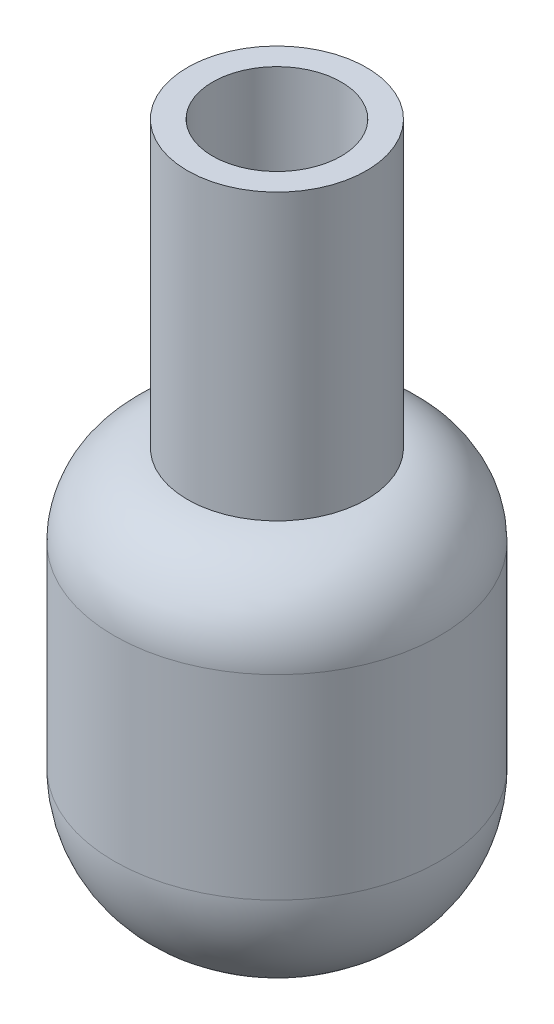
ISO-10303-21;
HEADER;
FILE_DESCRIPTION(('STEP AP214'),'2;1');
FILE_NAME('part.step','',(''),(''),'','','');
FILE_SCHEMA(('AUTOMOTIVE_DESIGN { 1 0 10303 214 1 1 1 1 }'));
ENDSEC;
DATA;
#1=APPLICATION_CONTEXT('core data for automotive mechanical design processes');
#2=APPLICATION_PROTOCOL_DEFINITION('international standard','automotive_design',2000,#1);
#3=PRODUCT_CONTEXT('',#1,'mechanical');
#4=PRODUCT('Part','Part','',(#3));
#5=PRODUCT_RELATED_PRODUCT_CATEGORY('part','',(#4));
#6=PRODUCT_DEFINITION_FORMATION('','',#4);
#7=PRODUCT_DEFINITION_CONTEXT('part definition',#1,'design');
#8=PRODUCT_DEFINITION('design','',#6,#7);
#9=PRODUCT_DEFINITION_SHAPE('','',#8);
#10=(LENGTH_UNIT() NAMED_UNIT(*) SI_UNIT(.MILLI.,.METRE.));
#11=(NAMED_UNIT(*) PLANE_ANGLE_UNIT() SI_UNIT($,.RADIAN.));
#12=(NAMED_UNIT(*) SI_UNIT($,.STERADIAN.) SOLID_ANGLE_UNIT());
#13=UNCERTAINTY_MEASURE_WITH_UNIT(LENGTH_MEASURE(1.E-05),#10,'distance_accuracy_value','');
#14=(GEOMETRIC_REPRESENTATION_CONTEXT(3) GLOBAL_UNCERTAINTY_ASSIGNED_CONTEXT((#13)) GLOBAL_UNIT_ASSIGNED_CONTEXT((#10,
#11,#12)) REPRESENTATION_CONTEXT('',''));
#15=CARTESIAN_POINT('',(0.,0.,0.));
#16=DIRECTION('',(0.,0.,1.));
#17=DIRECTION('',(1.,0.,0.));
#18=AXIS2_PLACEMENT_3D('',#15,#16,#17);
#19=CARTESIAN_POINT('',(0.,63.5,0.));
#20=DIRECTION('',(0.,-1.,0.));
#21=DIRECTION('',(0.,0.,-1.));
#22=AXIS2_PLACEMENT_3D('',#19,#20,#21);
#23=CYLINDRICAL_SURFACE('',#22,25.4);
#24=CARTESIAN_POINT('',(0.,50.8,0.));
#25=DIRECTION('',(0.,1.,0.));
#26=DIRECTION('',(0.,0.,1.));
#27=AXIS2_PLACEMENT_3D('',#24,#25,#26);
#28=CIRCLE('',#27,25.4);
#29=CARTESIAN_POINT('',(0.,50.8,25.4));
#30=VERTEX_POINT('',#29);
#31=EDGE_CURVE('E10',#30,#30,#28,.F.);
#32=ORIENTED_EDGE('',*,*,#31,.T.);
#33=EDGE_LOOP('',(#32));
#34=FACE_BOUND('',#33,.T.);
#35=CARTESIAN_POINT('',(0.,20.32,0.));
#36=DIRECTION('',(0.,1.,0.));
#37=DIRECTION('',(0.,0.,1.));
#38=AXIS2_PLACEMENT_3D('',#35,#36,#37);
#39=CIRCLE('',#38,25.4);
#40=CARTESIAN_POINT('',(0.,20.32,25.4));
#41=VERTEX_POINT('',#40);
#42=EDGE_CURVE('E48',#41,#41,#39,.T.);
#43=ORIENTED_EDGE('',*,*,#42,.T.);
#44=EDGE_LOOP('',(#43));
#45=FACE_BOUND('',#44,.T.);
#46=ADVANCED_FACE('F33',(#34,#45),#23,.T.);
#47=CARTESIAN_POINT('',(0.,0.,0.));
#48=DIRECTION('',(0.,1.,0.));
#49=DIRECTION('',(0.,0.,1.));
#50=AXIS2_PLACEMENT_3D('',#47,#48,#49);
#51=PLANE('',#50);
#52=CARTESIAN_POINT('',(0.,0.,0.));
#53=DIRECTION('',(0.,1.,0.));
#54=DIRECTION('',(0.,0.,1.));
#55=AXIS2_PLACEMENT_3D('',#52,#53,#54);
#56=CIRCLE('',#55,5.08);
#57=CARTESIAN_POINT('',(0.,0.,5.08));
#58=VERTEX_POINT('',#57);
#59=EDGE_CURVE('E44',#58,#58,#56,.F.);
#60=ORIENTED_EDGE('',*,*,#59,.T.);
#61=EDGE_LOOP('',(#60));
#62=FACE_BOUND('',#61,.T.);
#63=ADVANCED_FACE('F105',(#62),#51,.F.);
#64=CARTESIAN_POINT('',(0.,20.32,0.));
#65=DIRECTION('',(0.,1.,0.));
#66=DIRECTION('',(0.,0.,1.));
#67=AXIS2_PLACEMENT_3D('',#64,#65,#66);
#68=DEGENERATE_TOROIDAL_SURFACE('',#67,5.08,20.32,.T.);
#69=ORIENTED_EDGE('',*,*,#59,.F.);
#70=EDGE_LOOP('',(#69));
#71=FACE_BOUND('',#70,.T.);
#72=ORIENTED_EDGE('',*,*,#42,.F.);
#73=EDGE_LOOP('',(#72));
#74=FACE_BOUND('',#73,.T.);
#75=ADVANCED_FACE('F108',(#71,#74),#68,.T.);
#76=CARTESIAN_POINT('',(0.,50.8,0.));
#77=DIRECTION('',(0.,1.,0.));
#78=DIRECTION('',(0.,0.,1.));
#79=AXIS2_PLACEMENT_3D('',#76,#77,#78);
#80=DEGENERATE_TOROIDAL_SURFACE('',#79,12.7,12.7,.T.);
#81=ORIENTED_EDGE('',*,*,#31,.F.);
#82=EDGE_LOOP('',(#81));
#83=FACE_BOUND('',#82,.T.);
#84=CARTESIAN_POINT('',(0.,63.5,0.));
#85=DIRECTION('',(0.,1.,0.));
#86=DIRECTION('',(0.,0.,1.));
#87=AXIS2_PLACEMENT_3D('',#84,#85,#86);
#88=CIRCLE('',#87,12.7);
#89=CARTESIAN_POINT('',(0.,63.5,12.7));
#90=VERTEX_POINT('',#89);
#91=EDGE_CURVE('E40',#90,#90,#88,.T.);
#92=ORIENTED_EDGE('',*,*,#91,.F.);
#93=EDGE_LOOP('',(#92));
#94=FACE_BOUND('',#93,.T.);
#95=ADVANCED_FACE('F35',(#83,#94),#80,.T.);
#96=CARTESIAN_POINT('',(0.,107.95,0.));
#97=DIRECTION('',(0.,-1.,0.));
#98=DIRECTION('',(0.,0.,-1.));
#99=AXIS2_PLACEMENT_3D('',#96,#97,#98);
#100=CYLINDRICAL_SURFACE('',#99,13.97);
#101=CARTESIAN_POINT('',(5.,88.9,-13.044573584445));
#102=CARTESIAN_POINT('',(5.0000003755297,88.7645245367838,-13.0445732561984));
#103=CARTESIAN_POINT('',(4.99448940611393,88.6290544878268,-13.0466897573885));
#104=CARTESIAN_POINT('',(4.97250062935171,88.3590898388245,-13.0550862289029));
#105=CARTESIAN_POINT('',(4.95601907615257,88.2245955878224,-13.0613676213064));
#106=CARTESIAN_POINT('',(4.91226103899427,87.957675272033,-13.0778872948267));
#107=CARTESIAN_POINT('',(4.88498844757683,87.8252484793575,-13.0881241490987));
#108=CARTESIAN_POINT('',(4.81990217128849,87.5633000736516,-13.1122326820367));
#109=CARTESIAN_POINT('',(4.78208433660193,87.4337796260652,-13.1261057915303));
#110=CARTESIAN_POINT('',(4.69636199818674,87.1788930865205,-13.1570191198188));
#111=CARTESIAN_POINT('',(4.64848441469832,87.0535169203709,-13.1740508719793));
#112=CARTESIAN_POINT('',(4.54298159705471,86.8073267520344,-13.2108037335343));
#113=CARTESIAN_POINT('',(4.4853527256949,86.6865144728094,-13.2305258458922));
#114=CARTESIAN_POINT('',(4.29847867549087,86.3320619860924,-13.2929022322843));
#115=CARTESIAN_POINT('',(4.15517988873623,86.1062107265934,-13.3387915970327));
#116=CARTESIAN_POINT('',(3.82845906694946,85.6720257017863,-13.4362929008798));
#117=CARTESIAN_POINT('',(3.64363078203942,85.4647924562799,-13.4880624691074));
#118=CARTESIAN_POINT('',(3.24202582842287,85.0834675434403,-13.5901821753381));
#119=CARTESIAN_POINT('',(3.02524311038346,84.909382165703,-13.6405320424209));
#120=CARTESIAN_POINT('',(2.55771814288205,84.594196051278,-13.7359942137402));
#121=CARTESIAN_POINT('',(2.30613959847556,84.4542679041743,-13.7808990547243));
#122=CARTESIAN_POINT('',(1.78112463861938,84.2191625812934,-13.8585269733523));
#123=CARTESIAN_POINT('',(1.50769511218238,84.1239713658105,-13.8912538721043));
#124=CARTESIAN_POINT('',(0.958242690593429,83.9848325257159,-13.9397158547765));
#125=CARTESIAN_POINT('',(0.68275217041004,83.9390033153067,-13.9560730255493));
#126=CARTESIAN_POINT('',(0.127537526608346,83.8938792158262,-13.9721748725733));
#127=CARTESIAN_POINT('',(-0.152185317569845,83.894570533805,-13.9719244728316));
#128=CARTESIAN_POINT('',(-0.694509650254769,83.9413308632,-13.9552460842318));
#129=CARTESIAN_POINT('',(-0.957314109178422,83.9853505706187,-13.9395487002042));
#130=CARTESIAN_POINT('',(-1.47152417654206,84.1140956006178,-13.8946810285712));
#131=CARTESIAN_POINT('',(-1.72292898712256,84.1988237675787,-13.8655097995273));
#132=CARTESIAN_POINT('',(-2.21137948295002,84.4076333218988,-13.7961031385541));
#133=CARTESIAN_POINT('',(-2.44817383330528,84.5322508295644,-13.7557180315816));
#134=CARTESIAN_POINT('',(-2.89805559534316,84.8168420637428,-13.6680204252575));
#135=CARTESIAN_POINT('',(-3.11113573378216,84.9768265927795,-13.6207058108465));
#136=CARTESIAN_POINT('',(-3.51967030740823,85.3376798818238,-13.5210726068629));
#137=CARTESIAN_POINT('',(-3.71356228797045,85.5402836548973,-13.4686217474373));
#138=CARTESIAN_POINT('',(-4.06517192179702,85.9755064424723,-13.3667074685465));
#139=CARTESIAN_POINT('',(-4.22288208268665,86.2081316581293,-13.3172446693952));
#140=CARTESIAN_POINT('',(-4.50027699030926,86.7024387654528,-13.22611808162));
#141=CARTESIAN_POINT('',(-4.619198514917,86.964581277177,-13.1846167715739));
#142=CARTESIAN_POINT('',(-4.81064299628088,87.5070423672242,-13.1159856729647));
#143=CARTESIAN_POINT('',(-4.88318902726255,87.7873518299564,-13.0888487385336));
#144=CARTESIAN_POINT('',(-4.9764283093209,88.3428690133055,-13.0536750674077));
#145=CARTESIAN_POINT('',(-4.99957947628041,88.6176067188258,-13.0447340262469));
#146=CARTESIAN_POINT('',(-5.00040887281865,89.1671277962269,-13.0444176082803));
#147=CARTESIAN_POINT('',(-4.97809707210266,89.4419111448855,-13.0530383802938));
#148=CARTESIAN_POINT('',(-4.89085744615455,89.9717374991984,-13.0859621460061));
#149=CARTESIAN_POINT('',(-4.82774562911973,90.2271258504086,-13.1095961554213));
#150=CARTESIAN_POINT('',(-4.66292793993853,90.7236066379173,-13.1691160517271));
#151=CARTESIAN_POINT('',(-4.56121459575963,90.9646962959883,-13.2050043105171));
#152=CARTESIAN_POINT('',(-4.31807031636548,91.4351283809193,-13.2865399318606));
#153=CARTESIAN_POINT('',(-4.17536759065753,91.6637587988037,-13.3324862941592));
#154=CARTESIAN_POINT('',(-3.85555110851541,92.0947934425446,-13.4284543613771));
#155=CARTESIAN_POINT('',(-3.67842575975907,92.2971887949751,-13.4784774358844));
#156=CARTESIAN_POINT('',(-3.38476743282726,92.582863942488,-13.5541614573815));
#157=CARTESIAN_POINT('',(-3.27899326734897,92.6773447803329,-13.5801989076426));
#158=CARTESIAN_POINT('',(-3.05967182205186,92.8570798848976,-13.6312862576025));
#159=CARTESIAN_POINT('',(-2.94612727921099,92.9423373733483,-13.6563365001781));
#160=CARTESIAN_POINT('',(-2.71190884072899,93.103062997484,-13.7047714319248));
#161=CARTESIAN_POINT('',(-2.59123201654656,93.1785270707389,-13.728155428114));
#162=CARTESIAN_POINT('',(-2.34360388178618,93.319024002035,-13.7725899193084));
#163=CARTESIAN_POINT('',(-2.21665526862575,93.3840612942832,-13.7936414050797));
#164=CARTESIAN_POINT('',(-1.9578833493841,93.5029199293594,-13.8327377950286));
#165=CARTESIAN_POINT('',(-1.82608515780559,93.5567914975933,-13.8507960862119));
#166=CARTESIAN_POINT('',(-1.55804763625515,93.6531843385657,-13.8835011869902));
#167=CARTESIAN_POINT('',(-1.42181016713342,93.6957103001719,-13.8981494055667));
#168=CARTESIAN_POINT('',(-1.14587821251182,93.7690181692636,-13.9236150318446));
#169=CARTESIAN_POINT('',(-1.00618421832985,93.7998017357423,-13.9344329806801));
#170=CARTESIAN_POINT('',(-0.724420974435483,93.8493101870183,-13.9519186212648));
#171=CARTESIAN_POINT('',(-0.582351846802756,93.8680356896459,-13.958586525653));
#172=CARTESIAN_POINT('',(-0.304678259047671,93.8925484653095,-13.9673303984632));
#173=CARTESIAN_POINT('',(-0.169137255747304,93.8989776714235,-13.969634133114));
#174=CARTESIAN_POINT('',(0.102076698528221,93.9007974701925,-13.9702853886447));
#175=CARTESIAN_POINT('',(0.237749678662891,93.8961843184305,-13.9686315675341));
#176=CARTESIAN_POINT('',(0.508101912507519,93.8759621610103,-13.9614114938062));
#177=CARTESIAN_POINT('',(0.64278160701289,93.860358371622,-13.9558470971911));
#178=CARTESIAN_POINT('',(0.910276104010568,93.8183061003069,-13.940955797573));
#179=CARTESIAN_POINT('',(1.04309019093159,93.7918535687083,-13.9316274895796));
#180=CARTESIAN_POINT('',(1.30309148791274,93.7290229131934,-13.909691428782));
#181=CARTESIAN_POINT('',(1.43033829306048,93.6928653196283,-13.8971568002567));
#182=CARTESIAN_POINT('',(1.68130722824093,93.6106951791414,-13.8690323900985));
#183=CARTESIAN_POINT('',(1.80502809179578,93.5646791404923,-13.8534415261554));
#184=CARTESIAN_POINT('',(2.04811546659278,93.4631746036065,-13.8195938102343));
#185=CARTESIAN_POINT('',(2.16748291221049,93.4076881527024,-13.8013375345933));
#186=CARTESIAN_POINT('',(2.40120994817178,93.2876502648657,-13.762599875894));
#187=CARTESIAN_POINT('',(2.51556771838796,93.2230955684877,-13.7421176933687));
#188=CARTESIAN_POINT('',(2.85900127031491,93.0109965754183,-13.6763513918362));
#189=CARTESIAN_POINT('',(3.07881673530174,92.8490215344562,-13.6281376472304));
#190=CARTESIAN_POINT('',(3.48892220825468,92.4918540910123,-13.5289683339381));
#191=CARTESIAN_POINT('',(3.67920206193115,92.2966503126966,-13.478011830369));
#192=CARTESIAN_POINT('',(3.94318195660193,91.9776005094033,-13.4022816836547));
#193=CARTESIAN_POINT('',(4.02926388631736,91.8640118161926,-13.3765895700775));
#194=CARTESIAN_POINT('',(4.19153906474045,91.6297039174616,-13.3266311878524));
#195=CARTESIAN_POINT('',(4.26773594430733,91.5089873539091,-13.3023643974744));
#196=CARTESIAN_POINT('',(4.40970829592401,91.2611194321915,-13.2559781988657));
#197=CARTESIAN_POINT('',(4.47547961558015,91.1339655365728,-13.2338596476082));
#198=CARTESIAN_POINT('',(4.59600093937751,90.8741504965317,-13.1924878212159));
#199=CARTESIAN_POINT('',(4.65075577133012,90.7414917953879,-13.1732332919349));
#200=CARTESIAN_POINT('',(4.74908577770836,90.4706892758111,-13.1381060698445));
#201=CARTESIAN_POINT('',(4.79258817160156,90.3325161100182,-13.1222555003987));
#202=CARTESIAN_POINT('',(4.86749673327408,90.0525872991622,-13.0946543029142));
#203=CARTESIAN_POINT('',(4.89890813689242,89.9108332331619,-13.0829019004279));
#204=CARTESIAN_POINT('',(4.94930802311806,89.6248621510626,-13.0639189094682));
#205=CARTESIAN_POINT('',(4.96829910518781,89.4806456568153,-13.0566873748316));
#206=CARTESIAN_POINT('',(4.99364447520658,89.1909506381949,-13.0470150465679));
#207=CARTESIAN_POINT('',(4.99999959675997,89.0454721977094,-13.0445739369128));
#208=CARTESIAN_POINT('',(5.,88.9,-13.044573584445));
#209=B_SPLINE_CURVE_WITH_KNOTS('',3,(#101,#102,#103,#104,#105,#106,#107,#108,#109,#110,#111,
#112,#113,#114,#115,#116,#117,#118,#119,#120,#121,#122,#123,#124,#125,#126,#127,#128,#129,#130,
#131,#132,#133,#134,#135,#136,#137,#138,#139,#140,#141,#142,#143,#144,#145,#146,#147,#148,#149,
#150,#151,#152,#153,#154,#155,#156,#157,#158,#159,#160,#161,#162,#163,#164,#165,#166,#167,#168,
#169,#170,#171,#172,#173,#174,#175,#176,#177,#178,#179,#180,#181,#182,#183,#184,#185,#186,#187,
#188,#189,#190,#191,#192,#193,#194,#195,#196,#197,#198,#199,#200,#201,#202,#203,#204,#205,#206,
#207,#208),.UNSPECIFIED.,.T.,.F.,(4,2,2,2,2,2,2,2,2,2,2,2,2,2,2,2,2,2,2,2,2,2,2,2,2,2,2,2,2,2,2,
2,2,2,2,2,2,2,2,2,2,2,2,2,2,2,2,2,2,2,2,2,2,4),(0.,0.406289193856644,0.81271718440067,
1.2189987017602,1.62544032719507,2.03080784597421,2.43632690042192,3.24674890070618,
4.090457692877,4.93432641421715,5.80402241042248,6.67344528903843,7.5084068983528,
8.3431209495821,9.14016434330447,9.93726343612597,10.7455603291426,11.5541044508006,
12.4060972703206,13.2582663579042,14.1263127358042,14.9939268785299,15.8172513911622,
16.6403953740191,17.4292119910626,18.2181813759513,19.0349166234262,19.8519273965662,
20.2840941525735,20.7161094612828,21.1483034063582,21.5803130615356,22.0103351375266,
22.4401792194168,22.8699625494063,23.2997238564331,23.7063617952148,24.1131376427379,
24.5197205602244,24.9264553873169,25.3246330353925,25.7229519464256,26.1211848568983,
26.5195612742473,27.3474871590135,28.1756970557476,28.6097142697316,29.0435716115609,
29.4776013224691,29.9114404100351,30.3480190969656,30.7844085161721,31.2207065737157,
31.6569758473744),.UNSPECIFIED.);
#210=CARTESIAN_POINT('',(5.,88.9,-13.044573584445));
#211=VERTEX_POINT('',#210);
#212=EDGE_CURVE('E63',#211,#211,#209,.T.);
#213=ORIENTED_EDGE('',*,*,#212,.F.);
#214=EDGE_LOOP('',(#213));
#215=FACE_BOUND('',#214,.T.);
#216=CARTESIAN_POINT('',(0.,107.95,0.));
#217=DIRECTION('',(0.,1.,0.));
#218=DIRECTION('',(0.,0.,1.));
#219=AXIS2_PLACEMENT_3D('',#216,#217,#218);
#220=CIRCLE('',#219,13.97);
#221=CARTESIAN_POINT('',(0.,107.95,13.97));
#222=VERTEX_POINT('',#221);
#223=EDGE_CURVE('E53',#222,#222,#220,.T.);
#224=ORIENTED_EDGE('',*,*,#223,.F.);
#225=EDGE_LOOP('',(#224));
#226=FACE_BOUND('',#225,.T.);
#227=CARTESIAN_POINT('',(0.,63.5,0.));
#228=DIRECTION('',(0.,1.,0.));
#229=DIRECTION('',(0.,0.,1.));
#230=AXIS2_PLACEMENT_3D('',#227,#228,#229);
#231=CIRCLE('',#230,13.97);
#232=CARTESIAN_POINT('',(0.,63.5,13.97));
#233=VERTEX_POINT('',#232);
#234=EDGE_CURVE('E54',#233,#233,#231,.T.);
#235=ORIENTED_EDGE('',*,*,#234,.T.);
#236=EDGE_LOOP('',(#235));
#237=FACE_BOUND('',#236,.T.);
#238=ADVANCED_FACE('F98',(#215,#226,#237),#100,.T.);
#239=CARTESIAN_POINT('',(0.,107.95,0.));
#240=DIRECTION('',(0.,1.,0.));
#241=DIRECTION('',(0.,0.,1.));
#242=AXIS2_PLACEMENT_3D('',#239,#240,#241);
#243=PLANE('',#242);
#244=CARTESIAN_POINT('',(0.,107.95,0.));
#245=DIRECTION('',(0.,1.,0.));
#246=DIRECTION('',(0.,0.,1.));
#247=AXIS2_PLACEMENT_3D('',#244,#245,#246);
#248=CIRCLE('',#247,10.033);
#249=CARTESIAN_POINT('',(0.,107.95,10.033));
#250=VERTEX_POINT('',#249);
#251=EDGE_CURVE('E60',#250,#250,#248,.T.);
#252=ORIENTED_EDGE('',*,*,#251,.F.);
#253=EDGE_LOOP('',(#252));
#254=FACE_BOUND('',#253,.T.);
#255=ORIENTED_EDGE('',*,*,#223,.T.);
#256=EDGE_LOOP('',(#255));
#257=FACE_BOUND('',#256,.T.);
#258=ADVANCED_FACE('F95',(#254,#257),#243,.T.);
#259=CARTESIAN_POINT('',(0.,63.5,0.));
#260=DIRECTION('',(0.,1.,0.));
#261=DIRECTION('',(0.,0.,1.));
#262=AXIS2_PLACEMENT_3D('',#259,#260,#261);
#263=PLANE('',#262);
#264=ORIENTED_EDGE('',*,*,#91,.T.);
#265=EDGE_LOOP('',(#264));
#266=FACE_BOUND('',#265,.T.);
#267=ORIENTED_EDGE('',*,*,#234,.F.);
#268=EDGE_LOOP('',(#267));
#269=FACE_BOUND('',#268,.T.);
#270=ADVANCED_FACE('F93',(#266,#269),#263,.F.);
#271=CARTESIAN_POINT('',(0.,57.15,0.));
#272=DIRECTION('',(0.,1.,0.));
#273=DIRECTION('',(0.,0.,1.));
#274=AXIS2_PLACEMENT_3D('',#271,#272,#273);
#275=CYLINDRICAL_SURFACE('',#274,10.033);
#276=CARTESIAN_POINT('',(5.,88.9,-8.69833828958152));
#277=CARTESIAN_POINT('',(4.99999934362908,89.0303983093495,-8.69833911929905));
#278=CARTESIAN_POINT('',(4.99489179866976,89.1608090121706,-8.70128073695589));
#279=CARTESIAN_POINT('',(4.97452949173626,89.4206250183961,-8.71293745227133));
#280=CARTESIAN_POINT('',(4.95926996353467,89.5500298206593,-8.72165526177093));
#281=CARTESIAN_POINT('',(4.91877067436647,89.8069907883031,-8.74455981643607));
#282=CARTESIAN_POINT('',(4.89351513608502,89.9345436991867,-8.75875520630972));
#283=CARTESIAN_POINT('',(4.83334415693335,90.1867077558446,-8.7921013052945));
#284=CARTESIAN_POINT('',(4.79842451884988,90.3113175978357,-8.81125416724985));
#285=CARTESIAN_POINT('',(4.68017182776383,90.6780908291176,-8.87497221115452));
#286=CARTESIAN_POINT('',(4.58307732503433,90.9148574724052,-8.92595823106833));
#287=CARTESIAN_POINT('',(4.35554681785373,91.3685562322426,-9.03915669823619));
#288=CARTESIAN_POINT('',(4.22510919840346,91.5854873873542,-9.10136968923417));
#289=CARTESIAN_POINT('',(3.92206760648828,92.013127415328,-9.23624290561219));
#290=CARTESIAN_POINT('',(3.74688499895034,92.2218713217802,-9.30934146067679));
#291=CARTESIAN_POINT('',(3.36453682315186,92.6086108532634,-9.45424123493744));
#292=CARTESIAN_POINT('',(3.15735548648204,92.786591226436,-9.52604179491241));
#293=CARTESIAN_POINT('',(2.81835377064969,93.0325749760584,-9.6298117924495));
#294=CARTESIAN_POINT('',(2.69639896945629,93.1131813964391,-9.6647521948972));
#295=CARTESIAN_POINT('',(2.44524241580368,93.2637366913469,-9.73132678750073));
#296=CARTESIAN_POINT('',(2.31604357380863,93.3336898047029,-9.76296229105635));
#297=CARTESIAN_POINT('',(2.05123528076997,93.4622468009492,-9.82201234302581));
#298=CARTESIAN_POINT('',(1.91562747520273,93.5208535774844,-9.84942796726473));
#299=CARTESIAN_POINT('',(1.63894142103206,93.626073188239,-9.89922758101062));
#300=CARTESIAN_POINT('',(1.49786375083729,93.6726872866605,-9.92161210083747));
#301=CARTESIAN_POINT('',(1.22151588942766,93.7504662869671,-9.95926902161636));
#302=CARTESIAN_POINT('',(1.08654060078985,93.7824906448305,-9.97493244874887));
#303=CARTESIAN_POINT('',(0.813898174194045,93.835265334185,-10.0008701249668));
#304=CARTESIAN_POINT('',(0.676231297673445,93.8560167550503,-10.0111448947884));
#305=CARTESIAN_POINT('',(0.39940707894408,93.8859650438194,-10.0260045556353));
#306=CARTESIAN_POINT('',(0.260250483259492,93.8951674487357,-10.0305921732723));
#307=CARTESIAN_POINT('',(-0.0184115070739841,93.9019078190599,-10.0339504307868));
#308=CARTESIAN_POINT('',(-0.157916880053645,93.8994464919681,-10.0327214234899));
#309=CARTESIAN_POINT('',(-0.423990748511665,93.8836155926107,-10.0248428249458));
#310=CARTESIAN_POINT('',(-0.550632204229427,93.8712102873718,-10.0186724469006));
#311=CARTESIAN_POINT('',(-0.802333044750621,93.8368412383976,-10.0016632405311));
#312=CARTESIAN_POINT('',(-0.927391916856981,93.8148744747635,-9.9908229372649));
#313=CARTESIAN_POINT('',(-1.17499942414665,93.7616254437212,-9.96473535261599));
#314=CARTESIAN_POINT('',(-1.29754888420537,93.7303462917079,-9.94948954511424));
#315=CARTESIAN_POINT('',(-1.53942428190137,93.658792526433,-9.91494951773873));
#316=CARTESIAN_POINT('',(-1.65874896535143,93.6185144681671,-9.89565374761072));
#317=CARTESIAN_POINT('',(-2.01397123314946,93.4835075332711,-9.831745010847));
#318=CARTESIAN_POINT('',(-2.2438958166929,93.3753045136502,-9.78146507398412));
#319=CARTESIAN_POINT('',(-2.68276036483059,93.126882508973,-9.67033214400205));
#320=CARTESIAN_POINT('',(-2.89169276181145,92.9866520373315,-9.60947535939276));
#321=CARTESIAN_POINT('',(-3.30375534144159,92.6629961266679,-9.47615142398393));
#322=CARTESIAN_POINT('',(-3.50449091257773,92.4767482894558,-9.40313061804456));
#323=CARTESIAN_POINT('',(-3.87322990878981,92.073750614541,-9.25735146491627));
#324=CARTESIAN_POINT('',(-4.0412084367512,91.8569777900324,-9.18459335829657));
#325=CARTESIAN_POINT('',(-4.27026789124682,91.5050154293008,-9.07929460965577));
#326=CARTESIAN_POINT('',(-4.34458681379841,91.3791203578077,-9.04386727450379));
#327=CARTESIAN_POINT('',(-4.48222725474449,91.1205980825825,-8.97644652428706));
#328=CARTESIAN_POINT('',(-4.54555340434184,90.9879737444398,-8.94445166531713));
#329=CARTESIAN_POINT('',(-4.66054554746272,90.7168619874216,-8.88507715908261));
#330=CARTESIAN_POINT('',(-4.71221855664017,90.5783781561618,-8.85769473747404));
#331=CARTESIAN_POINT('',(-4.8033159660889,90.2964556197892,-8.80862799105141));
#332=CARTESIAN_POINT('',(-4.84274202501929,90.1530175885723,-8.78694289468459));
#333=CARTESIAN_POINT('',(-4.90616121937321,89.8738689574998,-8.75167878480003));
#334=CARTESIAN_POINT('',(-4.93112750077424,89.7384430922759,-8.73759472587064));
#335=CARTESIAN_POINT('',(-4.96982877311653,89.4655030833136,-8.71564052963814));
#336=CARTESIAN_POINT('',(-4.98356512515851,89.3279891947083,-8.70776963928458));
#337=CARTESIAN_POINT('',(-4.99959238997841,89.0521539202781,-8.6985775371603));
#338=CARTESIAN_POINT('',(-5.0018897432284,88.9138330327497,-8.69725263981809));
#339=CARTESIAN_POINT('',(-4.9950199651374,88.6375783856834,-8.7011999435073));
#340=CARTESIAN_POINT('',(-4.98585359556057,88.4996446010329,-8.7064717061908));
#341=CARTESIAN_POINT('',(-4.95781461015646,88.240314240979,-8.72246467042907));
#342=CARTESIAN_POINT('',(-4.9401052045901,88.1187496633153,-8.73253132187425));
#343=CARTESIAN_POINT('',(-4.89591147029198,87.8777049438923,-8.75738382855477));
#344=CARTESIAN_POINT('',(-4.86942443607821,87.7582254567765,-8.77217113876216));
#345=CARTESIAN_POINT('',(-4.77719635363844,87.4040740920146,-8.82295246316369));
#346=CARTESIAN_POINT('',(-4.698669556674,87.1735197743802,-8.86537732096152));
#347=CARTESIAN_POINT('',(-4.50600461628393,86.7182695677409,-8.9648875370562));
#348=CARTESIAN_POINT('',(-4.3903846295945,86.4943404817948,-9.02256125146245));
#349=CARTESIAN_POINT('',(-4.12807343254747,86.0677331868028,-9.14554894817742));
#350=CARTESIAN_POINT('',(-3.98136627496948,85.8650659648363,-9.21086684409979));
#351=CARTESIAN_POINT('',(-3.63965253865807,85.4602870591657,-9.35159252363174));
#352=CARTESIAN_POINT('',(-3.4409001233038,85.2614146178701,-9.42724057028579));
#353=CARTESIAN_POINT('',(-3.01147429317662,84.8987644218991,-9.57305469910483));
#354=CARTESIAN_POINT('',(-2.78079036167839,84.7349982750471,-9.6432189632109));
#355=CARTESIAN_POINT('',(-2.41160149412406,84.5176081423558,-9.73971899337683));
#356=CARTESIAN_POINT('',(-2.28284897871938,84.449160055462,-9.77077092619674));
#357=CARTESIAN_POINT('',(-2.019094955583,84.3234771838448,-9.82865851508105));
#358=CARTESIAN_POINT('',(-1.88409624686887,84.2662374355158,-9.85549603644738));
#359=CARTESIAN_POINT('',(-1.60885799435885,84.1636360616559,-9.90415038539123));
#360=CARTESIAN_POINT('',(-1.46862096522139,84.1182688183772,-9.92596958690751));
#361=CARTESIAN_POINT('',(-1.18397006073996,84.0399595160352,-9.96393028343348));
#362=CARTESIAN_POINT('',(-1.03955667884979,84.0070159954622,-9.98007244626713));
#363=CARTESIAN_POINT('',(-0.761176892206537,83.9564428844044,-10.0049692631753));
#364=CARTESIAN_POINT('',(-0.627462078051565,83.9376887975095,-10.014264290323));
#365=CARTESIAN_POINT('',(-0.358693605264234,83.9110551526802,-10.0274884516198));
#366=CARTESIAN_POINT('',(-0.22364004973472,83.9031747637642,-10.0314179958057));
#367=CARTESIAN_POINT('',(0.0466700729618312,83.8983912774319,-10.033801605003));
#368=CARTESIAN_POINT('',(0.181926570561351,83.9014850231847,-10.0322572446436));
#369=CARTESIAN_POINT('',(0.451569386202809,83.9186010056074,-10.0237403339535));
#370=CARTESIAN_POINT('',(0.585955727586544,83.9326229478953,-10.0167679298426));
#371=CARTESIAN_POINT('',(0.844045430512175,83.9701463738177,-9.99821470596076));
#372=CARTESIAN_POINT('',(0.967872084847842,83.9929669674855,-9.98696556409867));
#373=CARTESIAN_POINT('',(1.21302444915669,84.0477456444583,-9.96016571660015));
#374=CARTESIAN_POINT('',(1.33434934899725,84.0797066393479,-9.94461364035796));
#375=CARTESIAN_POINT('',(1.6933461071652,84.188842386447,-9.89201457826235));
#376=CARTESIAN_POINT('',(1.92625758613809,84.2793020851622,-9.849008225531));
#377=CARTESIAN_POINT('',(2.38345335092866,84.4970337127036,-9.74871759656111));
#378=CARTESIAN_POINT('',(2.6069373333479,84.6257199702494,-9.69089937564582));
#379=CARTESIAN_POINT('',(3.03010659105718,84.9145139431774,-9.56703643880614));
#380=CARTESIAN_POINT('',(3.22978085738201,85.0746361038101,-9.50098794606935));
#381=CARTESIAN_POINT('',(3.62041707339676,85.4400749237832,-9.3595404160978));
#382=CARTESIAN_POINT('',(3.80856217555741,85.6482957313881,-9.28386280942));
#383=CARTESIAN_POINT('',(4.14833442884686,86.0946590920301,-9.13710764656557));
#384=CARTESIAN_POINT('',(4.29992963589089,86.3328275443015,-9.0660341537021));
#385=CARTESIAN_POINT('',(4.49843152708499,86.7124411215047,-8.96832664003055));
#386=CARTESIAN_POINT('',(4.56049448289761,86.8449051268141,-8.93683382042333));
#387=CARTESIAN_POINT('',(4.6730538591818,87.1156176892193,-8.87849500115517));
#388=CARTESIAN_POINT('',(4.72355623501916,87.2538632243852,-8.85164661069288));
#389=CARTESIAN_POINT('',(4.81226722006325,87.5348129567,-8.80373293835309));
#390=CARTESIAN_POINT('',(4.85050748958153,87.67750461047,-8.7826527841038));
#391=CARTESIAN_POINT('',(4.91429640947163,87.9664330421946,-8.74712076895378));
#392=CARTESIAN_POINT('',(4.93985395417417,88.1126672600686,-8.732664263469));
#393=CARTESIAN_POINT('',(4.97253840595299,88.3658890567613,-8.71407983996791));
#394=CARTESIAN_POINT('',(4.98282686616666,88.4723518694658,-8.70819076753781));
#395=CARTESIAN_POINT('',(4.99655816035726,88.6858736435505,-8.70031952176045));
#396=CARTESIAN_POINT('',(5.0000005389326,88.7929326441141,-8.69833760831761));
#397=CARTESIAN_POINT('',(5.,88.9,-8.69833828958152));
#398=B_SPLINE_CURVE_WITH_KNOTS('',3,(#276,#277,#278,#279,#280,#281,#282,#283,#284,#285,#286,
#287,#288,#289,#290,#291,#292,#293,#294,#295,#296,#297,#298,#299,#300,#301,#302,#303,#304,#305,
#306,#307,#308,#309,#310,#311,#312,#313,#314,#315,#316,#317,#318,#319,#320,#321,#322,#323,#324,
#325,#326,#327,#328,#329,#330,#331,#332,#333,#334,#335,#336,#337,#338,#339,#340,#341,#342,#343,
#344,#345,#346,#347,#348,#349,#350,#351,#352,#353,#354,#355,#356,#357,#358,#359,#360,#361,#362,
#363,#364,#365,#366,#367,#368,#369,#370,#371,#372,#373,#374,#375,#376,#377,#378,#379,#380,#381,
#382,#383,#384,#385,#386,#387,#388,#389,#390,#391,#392,#393,#394,#395,#396,#397),.UNSPECIFIED.,
.T.,.F.,(4,2,2,2,2,2,2,2,2,2,2,2,2,2,2,2,2,2,2,2,2,2,2,2,2,2,2,2,2,2,2,2,2,2,2,2,2,2,2,2,2,2,2,
2,2,2,2,2,2,2,2,2,2,2,2,2,2,2,2,2,4),(0.,0.391083801899815,0.782351342379735,1.17423892298888,
1.56629697203687,2.34541108847825,3.12456294905611,3.96753242060126,4.81091862587406,
5.26133619444837,5.71157407614094,6.16169698242239,6.61177241976241,7.03001746775463,
7.44822209092678,7.8662261351129,8.28420482427409,8.66594399979565,9.04780383171171,
9.42953605834421,9.81141467269861,10.5850011940585,11.3588655976573,12.2055260529182,
13.0528275287788,13.503612919765,13.9542079336536,14.4045309428925,14.8547929362596,
15.2694840827304,15.6841249599511,16.0985323564941,16.5129122171361,16.8822548556652,
17.2517114407666,17.9901178550307,18.7627483182245,19.5357760921482,20.4054794844429,
21.2754700003171,21.7222186148503,22.1687689373632,22.6151075807493,23.0613937010786,
23.4668886910943,23.8723526909597,24.2777000640935,24.6830365184257,25.0618297975376,
25.4407438721588,26.1979182422683,26.9876162412443,27.7776779707778,28.6459119276769,
29.5149019800303,29.9632825288043,30.4114315745126,30.8584140204096,31.3050825552153,
31.6261720213221,31.9472828455967),.UNSPECIFIED.);
#399=CARTESIAN_POINT('',(5.,88.9,-8.69833828958152));
#400=VERTEX_POINT('',#399);
#401=EDGE_CURVE('E73',#400,#400,#398,.T.);
#402=ORIENTED_EDGE('',*,*,#401,.F.);
#403=EDGE_LOOP('',(#402));
#404=FACE_BOUND('',#403,.T.);
#405=CARTESIAN_POINT('',(0.,57.15,0.));
#406=DIRECTION('',(0.,1.,0.));
#407=DIRECTION('',(0.,0.,1.));
#408=AXIS2_PLACEMENT_3D('',#405,#406,#407);
#409=CIRCLE('',#408,10.033);
#410=CARTESIAN_POINT('',(0.,57.15,10.033));
#411=VERTEX_POINT('',#410);
#412=EDGE_CURVE('E57',#411,#411,#409,.T.);
#413=ORIENTED_EDGE('',*,*,#412,.F.);
#414=EDGE_LOOP('',(#413));
#415=FACE_BOUND('',#414,.T.);
#416=ORIENTED_EDGE('',*,*,#251,.T.);
#417=EDGE_LOOP('',(#416));
#418=FACE_BOUND('',#417,.T.);
#419=ADVANCED_FACE('F89',(#404,#415,#418),#275,.F.);
#420=CARTESIAN_POINT('',(0.,57.15,0.));
#421=DIRECTION('',(0.,1.,0.));
#422=DIRECTION('',(0.,0.,1.));
#423=AXIS2_PLACEMENT_3D('',#420,#421,#422);
#424=PLANE('',#423);
#425=ORIENTED_EDGE('',*,*,#412,.T.);
#426=EDGE_LOOP('',(#425));
#427=FACE_BOUND('',#426,.T.);
#428=ADVANCED_FACE('F84',(#427),#424,.T.);
#429=CARTESIAN_POINT('',(0.,88.9,-25.401));
#430=DIRECTION('',(0.,0.,1.));
#431=DIRECTION('',(1.,0.,0.));
#432=AXIS2_PLACEMENT_3D('',#429,#430,#431);
#433=CYLINDRICAL_SURFACE('',#432,5.);
#434=ORIENTED_EDGE('',*,*,#401,.T.);
#435=EDGE_LOOP('',(#434));
#436=FACE_BOUND('',#435,.T.);
#437=ORIENTED_EDGE('',*,*,#212,.T.);
#438=EDGE_LOOP('',(#437));
#439=FACE_BOUND('',#438,.T.);
#440=ADVANCED_FACE('F78',(#436,#439),#433,.F.);
#441=CLOSED_SHELL('',(#46,#63,#75,#95,#238,#258,#270,#419,#428,#440));
#442=MANIFOLD_SOLID_BREP('B2',#441);
#443=ADVANCED_BREP_SHAPE_REPRESENTATION('',(#18,#442),#14);
#444=SHAPE_DEFINITION_REPRESENTATION(#9,#443);
ENDSEC;
END-ISO-10303-21;
